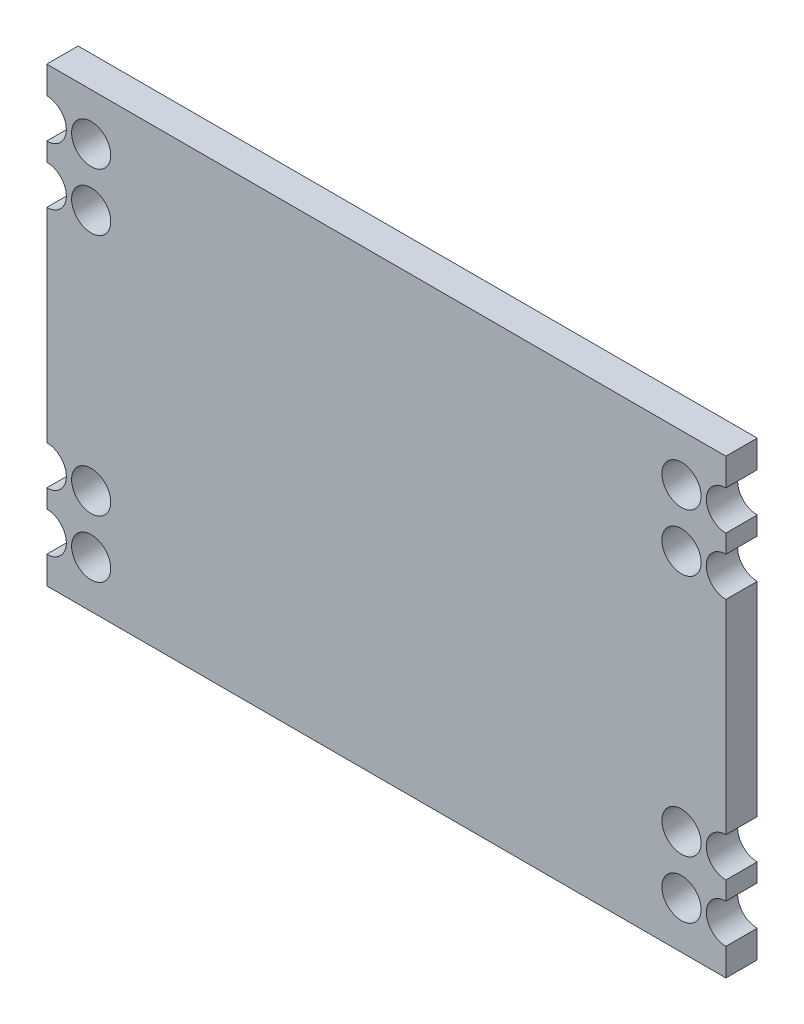
ISO-10303-21;
HEADER;
FILE_DESCRIPTION(('STEP AP214'),'2;1');
FILE_NAME('part.step','',(''),(''),'','','');
FILE_SCHEMA(('AUTOMOTIVE_DESIGN { 1 0 10303 214 1 1 1 1 }'));
ENDSEC;
DATA;
#1=APPLICATION_CONTEXT('core data for automotive mechanical design processes');
#2=APPLICATION_PROTOCOL_DEFINITION('international standard','automotive_design',2000,#1);
#3=PRODUCT_CONTEXT('',#1,'mechanical');
#4=PRODUCT('Part','Part','',(#3));
#5=PRODUCT_RELATED_PRODUCT_CATEGORY('part','',(#4));
#6=PRODUCT_DEFINITION_FORMATION('','',#4);
#7=PRODUCT_DEFINITION_CONTEXT('part definition',#1,'design');
#8=PRODUCT_DEFINITION('design','',#6,#7);
#9=PRODUCT_DEFINITION_SHAPE('','',#8);
#10=(LENGTH_UNIT() NAMED_UNIT(*) SI_UNIT(.MILLI.,.METRE.));
#11=(NAMED_UNIT(*) PLANE_ANGLE_UNIT() SI_UNIT($,.RADIAN.));
#12=(NAMED_UNIT(*) SI_UNIT($,.STERADIAN.) SOLID_ANGLE_UNIT());
#13=UNCERTAINTY_MEASURE_WITH_UNIT(LENGTH_MEASURE(1.E-05),#10,'distance_accuracy_value','');
#14=(GEOMETRIC_REPRESENTATION_CONTEXT(3) GLOBAL_UNCERTAINTY_ASSIGNED_CONTEXT((#13)) GLOBAL_UNIT_ASSIGNED_CONTEXT((#10,
#11,#12)) REPRESENTATION_CONTEXT('',''));
#15=CARTESIAN_POINT('',(0.,0.,0.));
#16=DIRECTION('',(0.,0.,1.));
#17=DIRECTION('',(1.,0.,0.));
#18=AXIS2_PLACEMENT_3D('',#15,#16,#17);
#19=CARTESIAN_POINT('',(13.,0.,1.2));
#20=DIRECTION('',(1.,0.,0.));
#21=DIRECTION('',(0.,0.,-1.));
#22=AXIS2_PLACEMENT_3D('',#19,#20,#21);
#23=PLANE('',#22);
#24=DIRECTION('',(0.,-1.,0.));
#25=VECTOR('',#24,1.);
#26=CARTESIAN_POINT('',(13.,0.,0.));
#27=LINE('',#26,#25);
#28=CARTESIAN_POINT('',(13.,3.9,0.));
#29=VERTEX_POINT('',#28);
#30=CARTESIAN_POINT('',(13.,-3.9,0.));
#31=VERTEX_POINT('',#30);
#32=EDGE_CURVE('E311',#29,#31,#27,.T.);
#33=ORIENTED_EDGE('',*,*,#32,.F.);
#34=DIRECTION('',(0.,0.,-1.));
#35=VECTOR('',#34,1.);
#36=CARTESIAN_POINT('',(13.,3.9,1.2));
#37=LINE('',#36,#35);
#38=CARTESIAN_POINT('',(13.,3.9,1.2));
#39=VERTEX_POINT('',#38);
#40=EDGE_CURVE('E11',#39,#29,#37,.T.);
#41=ORIENTED_EDGE('',*,*,#40,.F.);
#42=DIRECTION('',(0.,-1.,0.));
#43=VECTOR('',#42,1.);
#44=CARTESIAN_POINT('',(13.,0.,1.2));
#45=LINE('',#44,#43);
#46=CARTESIAN_POINT('',(13.,-3.9,1.2));
#47=VERTEX_POINT('',#46);
#48=EDGE_CURVE('E213',#39,#47,#45,.T.);
#49=ORIENTED_EDGE('',*,*,#48,.T.);
#50=DIRECTION('',(0.,0.,-1.));
#51=VECTOR('',#50,1.);
#52=CARTESIAN_POINT('',(13.,-3.9,1.2));
#53=LINE('',#52,#51);
#54=EDGE_CURVE('E63',#47,#31,#53,.T.);
#55=ORIENTED_EDGE('',*,*,#54,.T.);
#56=EDGE_LOOP('',(#33,#41,#49,#55));
#57=FACE_BOUND('',#56,.T.);
#58=ADVANCED_FACE('F45',(#57),#23,.T.);
#59=CARTESIAN_POINT('',(13.,4.65,1.2));
#60=DIRECTION('',(0.,0.,-1.));
#61=DIRECTION('',(-1.,0.,0.));
#62=AXIS2_PLACEMENT_3D('',#59,#60,#61);
#63=CYLINDRICAL_SURFACE('',#62,0.75);
#64=CARTESIAN_POINT('',(13.,4.65,0.));
#65=DIRECTION('',(0.,0.,1.));
#66=DIRECTION('',(1.,0.,0.));
#67=AXIS2_PLACEMENT_3D('',#64,#65,#66);
#68=CIRCLE('',#67,0.75);
#69=CARTESIAN_POINT('',(13.,5.4,0.));
#70=VERTEX_POINT('',#69);
#71=EDGE_CURVE('E314',#29,#70,#68,.F.);
#72=ORIENTED_EDGE('',*,*,#71,.T.);
#73=DIRECTION('',(0.,0.,-1.));
#74=VECTOR('',#73,1.);
#75=CARTESIAN_POINT('',(13.,5.4,1.2));
#76=LINE('',#75,#74);
#77=CARTESIAN_POINT('',(13.,5.4,1.2));
#78=VERTEX_POINT('',#77);
#79=EDGE_CURVE('E55',#78,#70,#76,.T.);
#80=ORIENTED_EDGE('',*,*,#79,.F.);
#81=CARTESIAN_POINT('',(13.,4.65,1.2));
#82=DIRECTION('',(0.,0.,1.));
#83=DIRECTION('',(1.,0.,0.));
#84=AXIS2_PLACEMENT_3D('',#81,#82,#83);
#85=CIRCLE('',#84,0.75);
#86=EDGE_CURVE('E225',#39,#78,#85,.F.);
#87=ORIENTED_EDGE('',*,*,#86,.F.);
#88=ORIENTED_EDGE('',*,*,#40,.T.);
#89=EDGE_LOOP('',(#72,#80,#87,#88));
#90=FACE_BOUND('',#89,.T.);
#91=ADVANCED_FACE('F425',(#90),#63,.F.);
#92=CARTESIAN_POINT('',(13.,6.09999999999999,0.));
#93=VERTEX_POINT('',#92);
#94=EDGE_CURVE('E316',#93,#70,#27,.T.);
#95=ORIENTED_EDGE('',*,*,#94,.F.);
#96=DIRECTION('',(0.,0.,-1.));
#97=VECTOR('',#96,1.);
#98=CARTESIAN_POINT('',(13.,6.09999999999999,1.2));
#99=LINE('',#98,#97);
#100=CARTESIAN_POINT('',(13.,6.09999999999999,1.2));
#101=VERTEX_POINT('',#100);
#102=EDGE_CURVE('E415',#101,#93,#99,.T.);
#103=ORIENTED_EDGE('',*,*,#102,.F.);
#104=EDGE_CURVE('E227',#101,#78,#45,.T.);
#105=ORIENTED_EDGE('',*,*,#104,.T.);
#106=ORIENTED_EDGE('',*,*,#79,.T.);
#107=EDGE_LOOP('',(#95,#103,#105,#106));
#108=FACE_BOUND('',#107,.T.);
#109=ADVANCED_FACE('F421',(#108),#23,.T.);
#110=CARTESIAN_POINT('',(13.,6.85,1.2));
#111=DIRECTION('',(0.,0.,-1.));
#112=DIRECTION('',(-1.,0.,0.));
#113=AXIS2_PLACEMENT_3D('',#110,#111,#112);
#114=CYLINDRICAL_SURFACE('',#113,0.750000000000013);
#115=CARTESIAN_POINT('',(13.,6.85,0.));
#116=DIRECTION('',(0.,0.,1.));
#117=DIRECTION('',(1.,0.,0.));
#118=AXIS2_PLACEMENT_3D('',#115,#116,#117);
#119=CIRCLE('',#118,0.750000000000013);
#120=CARTESIAN_POINT('',(13.,7.60000000000001,0.));
#121=VERTEX_POINT('',#120);
#122=EDGE_CURVE('E320',#93,#121,#119,.F.);
#123=ORIENTED_EDGE('',*,*,#122,.T.);
#124=DIRECTION('',(0.,0.,-1.));
#125=VECTOR('',#124,1.);
#126=CARTESIAN_POINT('',(13.,7.60000000000001,1.2));
#127=LINE('',#126,#125);
#128=CARTESIAN_POINT('',(13.,7.60000000000001,1.2));
#129=VERTEX_POINT('',#128);
#130=EDGE_CURVE('E413',#129,#121,#127,.T.);
#131=ORIENTED_EDGE('',*,*,#130,.F.);
#132=CARTESIAN_POINT('',(13.,6.85,1.2));
#133=DIRECTION('',(0.,0.,1.));
#134=DIRECTION('',(1.,0.,0.));
#135=AXIS2_PLACEMENT_3D('',#132,#133,#134);
#136=CIRCLE('',#135,0.750000000000013);
#137=EDGE_CURVE('E235',#101,#129,#136,.F.);
#138=ORIENTED_EDGE('',*,*,#137,.F.);
#139=ORIENTED_EDGE('',*,*,#102,.T.);
#140=EDGE_LOOP('',(#123,#131,#138,#139));
#141=FACE_BOUND('',#140,.T.);
#142=ADVANCED_FACE('F459',(#141),#114,.F.);
#143=CARTESIAN_POINT('',(13.,8.65,0.));
#144=VERTEX_POINT('',#143);
#145=EDGE_CURVE('E324',#144,#121,#27,.T.);
#146=ORIENTED_EDGE('',*,*,#145,.F.);
#147=DIRECTION('',(0.,0.,-1.));
#148=VECTOR('',#147,1.);
#149=CARTESIAN_POINT('',(13.,8.65,1.2));
#150=LINE('',#149,#148);
#151=CARTESIAN_POINT('',(13.,8.65,1.2));
#152=VERTEX_POINT('',#151);
#153=EDGE_CURVE('E411',#152,#144,#150,.T.);
#154=ORIENTED_EDGE('',*,*,#153,.F.);
#155=EDGE_CURVE('E223',#152,#129,#45,.T.);
#156=ORIENTED_EDGE('',*,*,#155,.T.);
#157=ORIENTED_EDGE('',*,*,#130,.T.);
#158=EDGE_LOOP('',(#146,#154,#156,#157));
#159=FACE_BOUND('',#158,.T.);
#160=ADVANCED_FACE('F460',(#159),#23,.T.);
#161=CARTESIAN_POINT('',(0.,8.65,1.2));
#162=DIRECTION('',(0.,1.,0.));
#163=DIRECTION('',(-1.,0.,0.));
#164=AXIS2_PLACEMENT_3D('',#161,#162,#163);
#165=PLANE('',#164);
#166=DIRECTION('',(1.,0.,0.));
#167=VECTOR('',#166,1.);
#168=CARTESIAN_POINT('',(0.,8.65,0.));
#169=LINE('',#168,#167);
#170=CARTESIAN_POINT('',(-13.,8.64999999999999,0.));
#171=VERTEX_POINT('',#170);
#172=EDGE_CURVE('E325',#171,#144,#169,.T.);
#173=ORIENTED_EDGE('',*,*,#172,.F.);
#174=DIRECTION('',(0.,0.,-1.));
#175=VECTOR('',#174,1.);
#176=CARTESIAN_POINT('',(-13.,8.64999999999999,1.2));
#177=LINE('',#176,#175);
#178=CARTESIAN_POINT('',(-13.,8.64999999999999,1.2));
#179=VERTEX_POINT('',#178);
#180=EDGE_CURVE('E408',#179,#171,#177,.T.);
#181=ORIENTED_EDGE('',*,*,#180,.F.);
#182=DIRECTION('',(1.,0.,0.));
#183=VECTOR('',#182,1.);
#184=CARTESIAN_POINT('',(0.,8.65,1.2));
#185=LINE('',#184,#183);
#186=EDGE_CURVE('E244',#179,#152,#185,.T.);
#187=ORIENTED_EDGE('',*,*,#186,.T.);
#188=ORIENTED_EDGE('',*,*,#153,.T.);
#189=EDGE_LOOP('',(#173,#181,#187,#188));
#190=FACE_BOUND('',#189,.T.);
#191=ADVANCED_FACE('F467',(#190),#165,.T.);
#192=CARTESIAN_POINT('',(-13.,0.,1.2));
#193=DIRECTION('',(1.,0.,0.));
#194=DIRECTION('',(0.,0.,-1.));
#195=AXIS2_PLACEMENT_3D('',#192,#193,#194);
#196=PLANE('',#195);
#197=DIRECTION('',(0.,-1.,0.));
#198=VECTOR('',#197,1.);
#199=CARTESIAN_POINT('',(-13.,0.,0.));
#200=LINE('',#199,#198);
#201=CARTESIAN_POINT('',(-13.,7.60000000000001,0.));
#202=VERTEX_POINT('',#201);
#203=EDGE_CURVE('E328',#171,#202,#200,.T.);
#204=ORIENTED_EDGE('',*,*,#203,.T.);
#205=DIRECTION('',(0.,0.,-1.));
#206=VECTOR('',#205,1.);
#207=CARTESIAN_POINT('',(-13.,7.60000000000001,1.2));
#208=LINE('',#207,#206);
#209=CARTESIAN_POINT('',(-13.,7.60000000000001,1.2));
#210=VERTEX_POINT('',#209);
#211=EDGE_CURVE('E406',#210,#202,#208,.T.);
#212=ORIENTED_EDGE('',*,*,#211,.F.);
#213=DIRECTION('',(0.,-1.,0.));
#214=VECTOR('',#213,1.);
#215=CARTESIAN_POINT('',(-13.,0.,1.2));
#216=LINE('',#215,#214);
#217=EDGE_CURVE('E249',#179,#210,#216,.T.);
#218=ORIENTED_EDGE('',*,*,#217,.F.);
#219=ORIENTED_EDGE('',*,*,#180,.T.);
#220=EDGE_LOOP('',(#204,#212,#218,#219));
#221=FACE_BOUND('',#220,.T.);
#222=ADVANCED_FACE('F471',(#221),#196,.F.);
#223=CARTESIAN_POINT('',(-13.,6.85,1.2));
#224=DIRECTION('',(0.,0.,-1.));
#225=DIRECTION('',(-1.,0.,0.));
#226=AXIS2_PLACEMENT_3D('',#223,#224,#225);
#227=CYLINDRICAL_SURFACE('',#226,0.750000000000013);
#228=CARTESIAN_POINT('',(-13.,6.85,0.));
#229=DIRECTION('',(0.,0.,1.));
#230=DIRECTION('',(1.,0.,0.));
#231=AXIS2_PLACEMENT_3D('',#228,#229,#230);
#232=CIRCLE('',#231,0.750000000000013);
#233=CARTESIAN_POINT('',(-13.,6.09999999999999,0.));
#234=VERTEX_POINT('',#233);
#235=EDGE_CURVE('E332',#234,#202,#232,.T.);
#236=ORIENTED_EDGE('',*,*,#235,.F.);
#237=DIRECTION('',(0.,0.,-1.));
#238=VECTOR('',#237,1.);
#239=CARTESIAN_POINT('',(-13.,6.09999999999999,1.2));
#240=LINE('',#239,#238);
#241=CARTESIAN_POINT('',(-13.,6.09999999999999,1.2));
#242=VERTEX_POINT('',#241);
#243=EDGE_CURVE('E403',#242,#234,#240,.T.);
#244=ORIENTED_EDGE('',*,*,#243,.F.);
#245=CARTESIAN_POINT('',(-13.,6.85,1.2));
#246=DIRECTION('',(0.,0.,1.));
#247=DIRECTION('',(1.,0.,0.));
#248=AXIS2_PLACEMENT_3D('',#245,#246,#247);
#249=CIRCLE('',#248,0.750000000000013);
#250=EDGE_CURVE('E256',#242,#210,#249,.T.);
#251=ORIENTED_EDGE('',*,*,#250,.T.);
#252=ORIENTED_EDGE('',*,*,#211,.T.);
#253=EDGE_LOOP('',(#236,#244,#251,#252));
#254=FACE_BOUND('',#253,.T.);
#255=ADVANCED_FACE('F535',(#254),#227,.F.);
#256=CARTESIAN_POINT('',(-13.,5.4,0.));
#257=VERTEX_POINT('',#256);
#258=EDGE_CURVE('E334',#234,#257,#200,.T.);
#259=ORIENTED_EDGE('',*,*,#258,.T.);
#260=DIRECTION('',(0.,0.,-1.));
#261=VECTOR('',#260,1.);
#262=CARTESIAN_POINT('',(-13.,5.4,1.2));
#263=LINE('',#262,#261);
#264=CARTESIAN_POINT('',(-13.,5.4,1.2));
#265=VERTEX_POINT('',#264);
#266=EDGE_CURVE('E400',#265,#257,#263,.T.);
#267=ORIENTED_EDGE('',*,*,#266,.F.);
#268=EDGE_CURVE('E259',#242,#265,#216,.T.);
#269=ORIENTED_EDGE('',*,*,#268,.F.);
#270=ORIENTED_EDGE('',*,*,#243,.T.);
#271=EDGE_LOOP('',(#259,#267,#269,#270));
#272=FACE_BOUND('',#271,.T.);
#273=ADVANCED_FACE('F509',(#272),#196,.F.);
#274=CARTESIAN_POINT('',(-13.,4.65,1.2));
#275=DIRECTION('',(0.,0.,-1.));
#276=DIRECTION('',(-1.,0.,0.));
#277=AXIS2_PLACEMENT_3D('',#274,#275,#276);
#278=CYLINDRICAL_SURFACE('',#277,0.75);
#279=CARTESIAN_POINT('',(-13.,4.65,0.));
#280=DIRECTION('',(0.,0.,1.));
#281=DIRECTION('',(1.,0.,0.));
#282=AXIS2_PLACEMENT_3D('',#279,#280,#281);
#283=CIRCLE('',#282,0.75);
#284=CARTESIAN_POINT('',(-13.,3.9,0.));
#285=VERTEX_POINT('',#284);
#286=EDGE_CURVE('E338',#285,#257,#283,.T.);
#287=ORIENTED_EDGE('',*,*,#286,.F.);
#288=DIRECTION('',(0.,0.,-1.));
#289=VECTOR('',#288,1.);
#290=CARTESIAN_POINT('',(-13.,3.9,1.2));
#291=LINE('',#290,#289);
#292=CARTESIAN_POINT('',(-13.,3.9,1.2));
#293=VERTEX_POINT('',#292);
#294=EDGE_CURVE('E397',#293,#285,#291,.T.);
#295=ORIENTED_EDGE('',*,*,#294,.F.);
#296=CARTESIAN_POINT('',(-13.,4.65,1.2));
#297=DIRECTION('',(0.,0.,1.));
#298=DIRECTION('',(1.,0.,0.));
#299=AXIS2_PLACEMENT_3D('',#296,#297,#298);
#300=CIRCLE('',#299,0.75);
#301=EDGE_CURVE('E264',#293,#265,#300,.T.);
#302=ORIENTED_EDGE('',*,*,#301,.T.);
#303=ORIENTED_EDGE('',*,*,#266,.T.);
#304=EDGE_LOOP('',(#287,#295,#302,#303));
#305=FACE_BOUND('',#304,.T.);
#306=ADVANCED_FACE('F514',(#305),#278,.F.);
#307=CARTESIAN_POINT('',(-13.,-3.9,0.));
#308=VERTEX_POINT('',#307);
#309=EDGE_CURVE('E342',#285,#308,#200,.T.);
#310=ORIENTED_EDGE('',*,*,#309,.T.);
#311=DIRECTION('',(0.,0.,-1.));
#312=VECTOR('',#311,1.);
#313=CARTESIAN_POINT('',(-13.,-3.9,1.2));
#314=LINE('',#313,#312);
#315=CARTESIAN_POINT('',(-13.,-3.9,1.2));
#316=VERTEX_POINT('',#315);
#317=EDGE_CURVE('E393',#316,#308,#314,.T.);
#318=ORIENTED_EDGE('',*,*,#317,.F.);
#319=EDGE_CURVE('E268',#293,#316,#216,.T.);
#320=ORIENTED_EDGE('',*,*,#319,.F.);
#321=ORIENTED_EDGE('',*,*,#294,.T.);
#322=EDGE_LOOP('',(#310,#318,#320,#321));
#323=FACE_BOUND('',#322,.T.);
#324=ADVANCED_FACE('F523',(#323),#196,.F.);
#325=CARTESIAN_POINT('',(-13.,-4.65,1.2));
#326=DIRECTION('',(0.,0.,-1.));
#327=DIRECTION('',(-1.,0.,0.));
#328=AXIS2_PLACEMENT_3D('',#325,#326,#327);
#329=CYLINDRICAL_SURFACE('',#328,0.75);
#330=CARTESIAN_POINT('',(-13.,-4.65,0.));
#331=DIRECTION('',(0.,0.,1.));
#332=DIRECTION('',(1.,0.,0.));
#333=AXIS2_PLACEMENT_3D('',#330,#331,#332);
#334=CIRCLE('',#333,0.75);
#335=CARTESIAN_POINT('',(-13.,-5.4,0.));
#336=VERTEX_POINT('',#335);
#337=EDGE_CURVE('E343',#308,#336,#334,.F.);
#338=ORIENTED_EDGE('',*,*,#337,.T.);
#339=DIRECTION('',(0.,0.,-1.));
#340=VECTOR('',#339,1.);
#341=CARTESIAN_POINT('',(-13.,-5.4,1.2));
#342=LINE('',#341,#340);
#343=CARTESIAN_POINT('',(-13.,-5.4,1.2));
#344=VERTEX_POINT('',#343);
#345=EDGE_CURVE('E389',#344,#336,#342,.T.);
#346=ORIENTED_EDGE('',*,*,#345,.F.);
#347=CARTESIAN_POINT('',(-13.,-4.65,1.2));
#348=DIRECTION('',(0.,0.,1.));
#349=DIRECTION('',(1.,0.,0.));
#350=AXIS2_PLACEMENT_3D('',#347,#348,#349);
#351=CIRCLE('',#350,0.75);
#352=EDGE_CURVE('E269',#316,#344,#351,.F.);
#353=ORIENTED_EDGE('',*,*,#352,.F.);
#354=ORIENTED_EDGE('',*,*,#317,.T.);
#355=EDGE_LOOP('',(#338,#346,#353,#354));
#356=FACE_BOUND('',#355,.T.);
#357=ADVANCED_FACE('F522',(#356),#329,.F.);
#358=CARTESIAN_POINT('',(-13.,-6.09999999999999,0.));
#359=VERTEX_POINT('',#358);
#360=EDGE_CURVE('E347',#336,#359,#200,.T.);
#361=ORIENTED_EDGE('',*,*,#360,.T.);
#362=DIRECTION('',(0.,0.,-1.));
#363=VECTOR('',#362,1.);
#364=CARTESIAN_POINT('',(-13.,-6.09999999999999,1.2));
#365=LINE('',#364,#363);
#366=CARTESIAN_POINT('',(-13.,-6.09999999999999,1.2));
#367=VERTEX_POINT('',#366);
#368=EDGE_CURVE('E385',#367,#359,#365,.T.);
#369=ORIENTED_EDGE('',*,*,#368,.F.);
#370=EDGE_CURVE('E273',#344,#367,#216,.T.);
#371=ORIENTED_EDGE('',*,*,#370,.F.);
#372=ORIENTED_EDGE('',*,*,#345,.T.);
#373=EDGE_LOOP('',(#361,#369,#371,#372));
#374=FACE_BOUND('',#373,.T.);
#375=ADVANCED_FACE('F496',(#374),#196,.F.);
#376=CARTESIAN_POINT('',(-13.,-6.85,1.2));
#377=DIRECTION('',(0.,0.,-1.));
#378=DIRECTION('',(-1.,0.,0.));
#379=AXIS2_PLACEMENT_3D('',#376,#377,#378);
#380=CYLINDRICAL_SURFACE('',#379,0.750000000000013);
#381=CARTESIAN_POINT('',(-13.,-6.85,0.));
#382=DIRECTION('',(0.,0.,1.));
#383=DIRECTION('',(1.,0.,0.));
#384=AXIS2_PLACEMENT_3D('',#381,#382,#383);
#385=CIRCLE('',#384,0.750000000000013);
#386=CARTESIAN_POINT('',(-13.,-7.60000000000001,0.));
#387=VERTEX_POINT('',#386);
#388=EDGE_CURVE('E348',#359,#387,#385,.F.);
#389=ORIENTED_EDGE('',*,*,#388,.T.);
#390=DIRECTION('',(0.,0.,-1.));
#391=VECTOR('',#390,1.);
#392=CARTESIAN_POINT('',(-13.,-7.60000000000001,1.2));
#393=LINE('',#392,#391);
#394=CARTESIAN_POINT('',(-13.,-7.60000000000001,1.2));
#395=VERTEX_POINT('',#394);
#396=EDGE_CURVE('E381',#395,#387,#393,.T.);
#397=ORIENTED_EDGE('',*,*,#396,.F.);
#398=CARTESIAN_POINT('',(-13.,-6.85,1.2));
#399=DIRECTION('',(0.,0.,1.));
#400=DIRECTION('',(1.,0.,0.));
#401=AXIS2_PLACEMENT_3D('',#398,#399,#400);
#402=CIRCLE('',#401,0.750000000000013);
#403=EDGE_CURVE('E274',#367,#395,#402,.F.);
#404=ORIENTED_EDGE('',*,*,#403,.F.);
#405=ORIENTED_EDGE('',*,*,#368,.T.);
#406=EDGE_LOOP('',(#389,#397,#404,#405));
#407=FACE_BOUND('',#406,.T.);
#408=ADVANCED_FACE('F491',(#407),#380,.F.);
#409=CARTESIAN_POINT('',(-13.,-8.65,0.));
#410=VERTEX_POINT('',#409);
#411=EDGE_CURVE('E333',#387,#410,#200,.T.);
#412=ORIENTED_EDGE('',*,*,#411,.T.);
#413=DIRECTION('',(0.,0.,-1.));
#414=VECTOR('',#413,1.);
#415=CARTESIAN_POINT('',(-13.,-8.65,1.2));
#416=LINE('',#415,#414);
#417=CARTESIAN_POINT('',(-13.,-8.65,1.2));
#418=VERTEX_POINT('',#417);
#419=EDGE_CURVE('E377',#418,#410,#416,.T.);
#420=ORIENTED_EDGE('',*,*,#419,.F.);
#421=EDGE_CURVE('E258',#395,#418,#216,.T.);
#422=ORIENTED_EDGE('',*,*,#421,.F.);
#423=ORIENTED_EDGE('',*,*,#396,.T.);
#424=EDGE_LOOP('',(#412,#420,#422,#423));
#425=FACE_BOUND('',#424,.T.);
#426=ADVANCED_FACE('F480',(#425),#196,.F.);
#427=CARTESIAN_POINT('',(0.,-8.65,1.2));
#428=DIRECTION('',(0.,1.,0.));
#429=DIRECTION('',(-1.,0.,0.));
#430=AXIS2_PLACEMENT_3D('',#427,#428,#429);
#431=PLANE('',#430);
#432=DIRECTION('',(1.,0.,0.));
#433=VECTOR('',#432,1.);
#434=CARTESIAN_POINT('',(0.,-8.65,0.));
#435=LINE('',#434,#433);
#436=CARTESIAN_POINT('',(13.,-8.65,0.));
#437=VERTEX_POINT('',#436);
#438=EDGE_CURVE('E352',#410,#437,#435,.T.);
#439=ORIENTED_EDGE('',*,*,#438,.T.);
#440=DIRECTION('',(0.,0.,-1.));
#441=VECTOR('',#440,1.);
#442=CARTESIAN_POINT('',(13.,-8.65,1.2));
#443=LINE('',#442,#441);
#444=CARTESIAN_POINT('',(13.,-8.65,1.2));
#445=VERTEX_POINT('',#444);
#446=EDGE_CURVE('E374',#445,#437,#443,.T.);
#447=ORIENTED_EDGE('',*,*,#446,.F.);
#448=DIRECTION('',(1.,0.,0.));
#449=VECTOR('',#448,1.);
#450=CARTESIAN_POINT('',(0.,-8.65,1.2));
#451=LINE('',#450,#449);
#452=EDGE_CURVE('E222',#418,#445,#451,.T.);
#453=ORIENTED_EDGE('',*,*,#452,.F.);
#454=ORIENTED_EDGE('',*,*,#419,.T.);
#455=EDGE_LOOP('',(#439,#447,#453,#454));
#456=FACE_BOUND('',#455,.T.);
#457=ADVANCED_FACE('F474',(#456),#431,.F.);
#458=CARTESIAN_POINT('',(13.,-7.60000000000001,0.));
#459=VERTEX_POINT('',#458);
#460=EDGE_CURVE('E356',#459,#437,#27,.T.);
#461=ORIENTED_EDGE('',*,*,#460,.F.);
#462=DIRECTION('',(0.,0.,-1.));
#463=VECTOR('',#462,1.);
#464=CARTESIAN_POINT('',(13.,-7.60000000000001,1.2));
#465=LINE('',#464,#463);
#466=CARTESIAN_POINT('',(13.,-7.60000000000001,1.2));
#467=VERTEX_POINT('',#466);
#468=EDGE_CURVE('E195',#467,#459,#465,.T.);
#469=ORIENTED_EDGE('',*,*,#468,.F.);
#470=EDGE_CURVE('E206',#467,#445,#45,.T.);
#471=ORIENTED_EDGE('',*,*,#470,.T.);
#472=ORIENTED_EDGE('',*,*,#446,.T.);
#473=EDGE_LOOP('',(#461,#469,#471,#472));
#474=FACE_BOUND('',#473,.T.);
#475=ADVANCED_FACE('F450',(#474),#23,.T.);
#476=CARTESIAN_POINT('',(13.,-6.85,1.2));
#477=DIRECTION('',(0.,0.,-1.));
#478=DIRECTION('',(-1.,0.,0.));
#479=AXIS2_PLACEMENT_3D('',#476,#477,#478);
#480=CYLINDRICAL_SURFACE('',#479,0.750000000000013);
#481=CARTESIAN_POINT('',(13.,-6.85,0.));
#482=DIRECTION('',(0.,0.,1.));
#483=DIRECTION('',(1.,0.,0.));
#484=AXIS2_PLACEMENT_3D('',#481,#482,#483);
#485=CIRCLE('',#484,0.750000000000013);
#486=CARTESIAN_POINT('',(13.,-6.09999999999999,0.));
#487=VERTEX_POINT('',#486);
#488=EDGE_CURVE('E190',#487,#459,#485,.T.);
#489=ORIENTED_EDGE('',*,*,#488,.F.);
#490=DIRECTION('',(0.,0.,-1.));
#491=VECTOR('',#490,1.);
#492=CARTESIAN_POINT('',(13.,-6.09999999999999,1.2));
#493=LINE('',#492,#491);
#494=CARTESIAN_POINT('',(13.,-6.09999999999999,1.2));
#495=VERTEX_POINT('',#494);
#496=EDGE_CURVE('E185',#495,#487,#493,.T.);
#497=ORIENTED_EDGE('',*,*,#496,.F.);
#498=CARTESIAN_POINT('',(13.,-6.85,1.2));
#499=DIRECTION('',(0.,0.,1.));
#500=DIRECTION('',(1.,0.,0.));
#501=AXIS2_PLACEMENT_3D('',#498,#499,#500);
#502=CIRCLE('',#501,0.750000000000013);
#503=EDGE_CURVE('E188',#495,#467,#502,.T.);
#504=ORIENTED_EDGE('',*,*,#503,.T.);
#505=ORIENTED_EDGE('',*,*,#468,.T.);
#506=EDGE_LOOP('',(#489,#497,#504,#505));
#507=FACE_BOUND('',#506,.T.);
#508=ADVANCED_FACE('F187',(#507),#480,.F.);
#509=CARTESIAN_POINT('',(13.,-5.4,0.));
#510=VERTEX_POINT('',#509);
#511=EDGE_CURVE('E315',#510,#487,#27,.T.);
#512=ORIENTED_EDGE('',*,*,#511,.F.);
#513=DIRECTION('',(0.,0.,-1.));
#514=VECTOR('',#513,1.);
#515=CARTESIAN_POINT('',(13.,-5.4,1.2));
#516=LINE('',#515,#514);
#517=CARTESIAN_POINT('',(13.,-5.4,1.2));
#518=VERTEX_POINT('',#517);
#519=EDGE_CURVE('E124',#518,#510,#516,.T.);
#520=ORIENTED_EDGE('',*,*,#519,.F.);
#521=EDGE_CURVE('E204',#518,#495,#45,.T.);
#522=ORIENTED_EDGE('',*,*,#521,.T.);
#523=ORIENTED_EDGE('',*,*,#496,.T.);
#524=EDGE_LOOP('',(#512,#520,#522,#523));
#525=FACE_BOUND('',#524,.T.);
#526=ADVANCED_FACE('F209',(#525),#23,.T.);
#527=CARTESIAN_POINT('',(13.,-4.65,1.2));
#528=DIRECTION('',(0.,0.,-1.));
#529=DIRECTION('',(-1.,0.,0.));
#530=AXIS2_PLACEMENT_3D('',#527,#528,#529);
#531=CYLINDRICAL_SURFACE('',#530,0.75);
#532=CARTESIAN_POINT('',(13.,-4.65,0.));
#533=DIRECTION('',(0.,0.,1.));
#534=DIRECTION('',(1.,0.,0.));
#535=AXIS2_PLACEMENT_3D('',#532,#533,#534);
#536=CIRCLE('',#535,0.75);
#537=EDGE_CURVE('E359',#31,#510,#536,.T.);
#538=ORIENTED_EDGE('',*,*,#537,.F.);
#539=ORIENTED_EDGE('',*,*,#54,.F.);
#540=CARTESIAN_POINT('',(13.,-4.65,1.2));
#541=DIRECTION('',(0.,0.,1.));
#542=DIRECTION('',(1.,0.,0.));
#543=AXIS2_PLACEMENT_3D('',#540,#541,#542);
#544=CIRCLE('',#543,0.75);
#545=EDGE_CURVE('E211',#47,#518,#544,.T.);
#546=ORIENTED_EDGE('',*,*,#545,.T.);
#547=ORIENTED_EDGE('',*,*,#519,.T.);
#548=EDGE_LOOP('',(#538,#539,#546,#547));
#549=FACE_BOUND('',#548,.T.);
#550=ADVANCED_FACE('F438',(#549),#531,.F.);
#551=CARTESIAN_POINT('',(-11.3,-6.85000000000003,1.2));
#552=DIRECTION('',(0.,0.,-1.));
#553=DIRECTION('',(-1.,0.,0.));
#554=AXIS2_PLACEMENT_3D('',#551,#552,#553);
#555=CYLINDRICAL_SURFACE('',#554,0.749999999999984);
#556=CARTESIAN_POINT('',(-11.3,-6.85000000000003,1.2));
#557=DIRECTION('',(0.,0.,1.));
#558=DIRECTION('',(1.,0.,0.));
#559=AXIS2_PLACEMENT_3D('',#556,#557,#558);
#560=CIRCLE('',#559,0.749999999999984);
#561=CARTESIAN_POINT('',(-10.55,-6.85000000000003,1.2));
#562=VERTEX_POINT('',#561);
#563=EDGE_CURVE('E226',#562,#562,#560,.F.);
#564=ORIENTED_EDGE('',*,*,#563,.F.);
#565=EDGE_LOOP('',(#564));
#566=FACE_BOUND('',#565,.T.);
#567=CARTESIAN_POINT('',(-11.3,-6.85000000000003,0.));
#568=DIRECTION('',(0.,0.,1.));
#569=DIRECTION('',(1.,0.,0.));
#570=AXIS2_PLACEMENT_3D('',#567,#568,#569);
#571=CIRCLE('',#570,0.749999999999984);
#572=CARTESIAN_POINT('',(-10.55,-6.85000000000003,0.));
#573=VERTEX_POINT('',#572);
#574=EDGE_CURVE('E307',#573,#573,#571,.F.);
#575=ORIENTED_EDGE('',*,*,#574,.T.);
#576=EDGE_LOOP('',(#575));
#577=FACE_BOUND('',#576,.T.);
#578=ADVANCED_FACE('F440',(#566,#577),#555,.F.);
#579=CARTESIAN_POINT('',(-11.3,6.85000000000003,1.2));
#580=DIRECTION('',(0.,0.,-1.));
#581=DIRECTION('',(-1.,0.,0.));
#582=AXIS2_PLACEMENT_3D('',#579,#580,#581);
#583=CYLINDRICAL_SURFACE('',#582,0.749999999999984);
#584=CARTESIAN_POINT('',(-11.3,6.85000000000003,1.2));
#585=DIRECTION('',(0.,0.,1.));
#586=DIRECTION('',(1.,0.,0.));
#587=AXIS2_PLACEMENT_3D('',#584,#585,#586);
#588=CIRCLE('',#587,0.749999999999984);
#589=CARTESIAN_POINT('',(-10.55,6.85000000000003,1.2));
#590=VERTEX_POINT('',#589);
#591=EDGE_CURVE('E232',#590,#590,#588,.T.);
#592=ORIENTED_EDGE('',*,*,#591,.T.);
#593=EDGE_LOOP('',(#592));
#594=FACE_BOUND('',#593,.T.);
#595=CARTESIAN_POINT('',(-11.3,6.85000000000003,0.));
#596=DIRECTION('',(0.,0.,1.));
#597=DIRECTION('',(1.,0.,0.));
#598=AXIS2_PLACEMENT_3D('',#595,#596,#597);
#599=CIRCLE('',#598,0.749999999999984);
#600=CARTESIAN_POINT('',(-10.55,6.85000000000003,0.));
#601=VERTEX_POINT('',#600);
#602=EDGE_CURVE('E303',#601,#601,#599,.T.);
#603=ORIENTED_EDGE('',*,*,#602,.F.);
#604=EDGE_LOOP('',(#603));
#605=FACE_BOUND('',#604,.T.);
#606=ADVANCED_FACE('F446',(#594,#605),#583,.F.);
#607=CARTESIAN_POINT('',(-11.3,4.65000000000003,1.2));
#608=DIRECTION('',(0.,0.,-1.));
#609=DIRECTION('',(-1.,0.,0.));
#610=AXIS2_PLACEMENT_3D('',#607,#608,#609);
#611=CYLINDRICAL_SURFACE('',#610,0.75);
#612=CARTESIAN_POINT('',(-11.3,4.65000000000003,1.2));
#613=DIRECTION('',(0.,0.,1.));
#614=DIRECTION('',(1.,0.,0.));
#615=AXIS2_PLACEMENT_3D('',#612,#613,#614);
#616=CIRCLE('',#615,0.75);
#617=CARTESIAN_POINT('',(-10.55,4.65000000000003,1.2));
#618=VERTEX_POINT('',#617);
#619=EDGE_CURVE('E811',#618,#618,#616,.T.);
#620=ORIENTED_EDGE('',*,*,#619,.T.);
#621=EDGE_LOOP('',(#620));
#622=FACE_BOUND('',#621,.T.);
#623=CARTESIAN_POINT('',(-11.3,4.65000000000003,0.));
#624=DIRECTION('',(0.,0.,1.));
#625=DIRECTION('',(1.,0.,0.));
#626=AXIS2_PLACEMENT_3D('',#623,#624,#625);
#627=CIRCLE('',#626,0.75);
#628=CARTESIAN_POINT('',(-10.55,4.65000000000003,0.));
#629=VERTEX_POINT('',#628);
#630=EDGE_CURVE('E299',#629,#629,#627,.T.);
#631=ORIENTED_EDGE('',*,*,#630,.F.);
#632=EDGE_LOOP('',(#631));
#633=FACE_BOUND('',#632,.T.);
#634=ADVANCED_FACE('F554',(#622,#633),#611,.F.);
#635=CARTESIAN_POINT('',(-11.3,-4.65000000000003,1.2));
#636=DIRECTION('',(0.,0.,-1.));
#637=DIRECTION('',(-1.,0.,0.));
#638=AXIS2_PLACEMENT_3D('',#635,#636,#637);
#639=CYLINDRICAL_SURFACE('',#638,0.75);
#640=CARTESIAN_POINT('',(-11.3,-4.65000000000003,1.2));
#641=DIRECTION('',(0.,0.,1.));
#642=DIRECTION('',(1.,0.,0.));
#643=AXIS2_PLACEMENT_3D('',#640,#641,#642);
#644=CIRCLE('',#643,0.75);
#645=CARTESIAN_POINT('',(-10.55,-4.65000000000003,1.2));
#646=VERTEX_POINT('',#645);
#647=EDGE_CURVE('E807',#646,#646,#644,.F.);
#648=ORIENTED_EDGE('',*,*,#647,.F.);
#649=EDGE_LOOP('',(#648));
#650=FACE_BOUND('',#649,.T.);
#651=CARTESIAN_POINT('',(-11.3,-4.65000000000003,0.));
#652=DIRECTION('',(0.,0.,1.));
#653=DIRECTION('',(1.,0.,0.));
#654=AXIS2_PLACEMENT_3D('',#651,#652,#653);
#655=CIRCLE('',#654,0.75);
#656=CARTESIAN_POINT('',(-10.55,-4.65000000000003,0.));
#657=VERTEX_POINT('',#656);
#658=EDGE_CURVE('E295',#657,#657,#655,.F.);
#659=ORIENTED_EDGE('',*,*,#658,.T.);
#660=EDGE_LOOP('',(#659));
#661=FACE_BOUND('',#660,.T.);
#662=ADVANCED_FACE('F558',(#650,#661),#639,.F.);
#663=CARTESIAN_POINT('',(11.3,-6.85000000000003,1.2));
#664=DIRECTION('',(0.,0.,-1.));
#665=DIRECTION('',(-1.,0.,0.));
#666=AXIS2_PLACEMENT_3D('',#663,#664,#665);
#667=CYLINDRICAL_SURFACE('',#666,0.749999999999984);
#668=CARTESIAN_POINT('',(11.3,-6.85000000000003,1.2));
#669=DIRECTION('',(0.,0.,1.));
#670=DIRECTION('',(1.,0.,0.));
#671=AXIS2_PLACEMENT_3D('',#668,#669,#670);
#672=CIRCLE('',#671,0.749999999999984);
#673=CARTESIAN_POINT('',(12.05,-6.85000000000003,1.2));
#674=VERTEX_POINT('',#673);
#675=EDGE_CURVE('E803',#674,#674,#672,.T.);
#676=ORIENTED_EDGE('',*,*,#675,.T.);
#677=EDGE_LOOP('',(#676));
#678=FACE_BOUND('',#677,.T.);
#679=CARTESIAN_POINT('',(11.3,-6.85000000000003,0.));
#680=DIRECTION('',(0.,0.,1.));
#681=DIRECTION('',(1.,0.,0.));
#682=AXIS2_PLACEMENT_3D('',#679,#680,#681);
#683=CIRCLE('',#682,0.749999999999984);
#684=CARTESIAN_POINT('',(12.05,-6.85000000000003,0.));
#685=VERTEX_POINT('',#684);
#686=EDGE_CURVE('E291',#685,#685,#683,.T.);
#687=ORIENTED_EDGE('',*,*,#686,.F.);
#688=EDGE_LOOP('',(#687));
#689=FACE_BOUND('',#688,.T.);
#690=ADVANCED_FACE('F562',(#678,#689),#667,.F.);
#691=CARTESIAN_POINT('',(11.3,-4.65000000000003,1.2));
#692=DIRECTION('',(0.,0.,-1.));
#693=DIRECTION('',(-1.,0.,0.));
#694=AXIS2_PLACEMENT_3D('',#691,#692,#693);
#695=CYLINDRICAL_SURFACE('',#694,0.75);
#696=CARTESIAN_POINT('',(11.3,-4.65000000000003,1.2));
#697=DIRECTION('',(0.,0.,1.));
#698=DIRECTION('',(1.,0.,0.));
#699=AXIS2_PLACEMENT_3D('',#696,#697,#698);
#700=CIRCLE('',#699,0.75);
#701=CARTESIAN_POINT('',(12.05,-4.65000000000003,1.2));
#702=VERTEX_POINT('',#701);
#703=EDGE_CURVE('E577',#702,#702,#700,.T.);
#704=ORIENTED_EDGE('',*,*,#703,.T.);
#705=EDGE_LOOP('',(#704));
#706=FACE_BOUND('',#705,.T.);
#707=CARTESIAN_POINT('',(11.3,-4.65000000000003,0.));
#708=DIRECTION('',(0.,0.,1.));
#709=DIRECTION('',(1.,0.,0.));
#710=AXIS2_PLACEMENT_3D('',#707,#708,#709);
#711=CIRCLE('',#710,0.75);
#712=CARTESIAN_POINT('',(12.05,-4.65000000000003,0.));
#713=VERTEX_POINT('',#712);
#714=EDGE_CURVE('E287',#713,#713,#711,.T.);
#715=ORIENTED_EDGE('',*,*,#714,.F.);
#716=EDGE_LOOP('',(#715));
#717=FACE_BOUND('',#716,.T.);
#718=ADVANCED_FACE('F565',(#706,#717),#695,.F.);
#719=CARTESIAN_POINT('',(11.3,6.85000000000003,1.2));
#720=DIRECTION('',(0.,0.,-1.));
#721=DIRECTION('',(-1.,0.,0.));
#722=AXIS2_PLACEMENT_3D('',#719,#720,#721);
#723=CYLINDRICAL_SURFACE('',#722,0.749999999999984);
#724=CARTESIAN_POINT('',(11.3,6.85000000000003,1.2));
#725=DIRECTION('',(0.,0.,1.));
#726=DIRECTION('',(1.,0.,0.));
#727=AXIS2_PLACEMENT_3D('',#724,#725,#726);
#728=CIRCLE('',#727,0.749999999999984);
#729=CARTESIAN_POINT('',(12.05,6.85000000000003,1.2));
#730=VERTEX_POINT('',#729);
#731=EDGE_CURVE('E367',#730,#730,#728,.F.);
#732=ORIENTED_EDGE('',*,*,#731,.F.);
#733=EDGE_LOOP('',(#732));
#734=FACE_BOUND('',#733,.T.);
#735=CARTESIAN_POINT('',(11.3,6.85000000000003,0.));
#736=DIRECTION('',(0.,0.,1.));
#737=DIRECTION('',(1.,0.,0.));
#738=AXIS2_PLACEMENT_3D('',#735,#736,#737);
#739=CIRCLE('',#738,0.749999999999984);
#740=CARTESIAN_POINT('',(12.05,6.85000000000003,0.));
#741=VERTEX_POINT('',#740);
#742=EDGE_CURVE('E283',#741,#741,#739,.F.);
#743=ORIENTED_EDGE('',*,*,#742,.T.);
#744=EDGE_LOOP('',(#743));
#745=FACE_BOUND('',#744,.T.);
#746=ADVANCED_FACE('F47',(#734,#745),#723,.F.);
#747=CARTESIAN_POINT('',(11.3,4.65000000000003,1.2));
#748=DIRECTION('',(0.,0.,-1.));
#749=DIRECTION('',(-1.,0.,0.));
#750=AXIS2_PLACEMENT_3D('',#747,#748,#749);
#751=CYLINDRICAL_SURFACE('',#750,0.75);
#752=CARTESIAN_POINT('',(11.3,4.65000000000003,1.2));
#753=DIRECTION('',(0.,0.,1.));
#754=DIRECTION('',(1.,0.,0.));
#755=AXIS2_PLACEMENT_3D('',#752,#753,#754);
#756=CIRCLE('',#755,0.75);
#757=CARTESIAN_POINT('',(12.05,4.65000000000003,1.2));
#758=VERTEX_POINT('',#757);
#759=EDGE_CURVE('E217',#758,#758,#756,.F.);
#760=ORIENTED_EDGE('',*,*,#759,.F.);
#761=EDGE_LOOP('',(#760));
#762=FACE_BOUND('',#761,.T.);
#763=CARTESIAN_POINT('',(11.3,4.65000000000003,0.));
#764=DIRECTION('',(0.,0.,1.));
#765=DIRECTION('',(1.,0.,0.));
#766=AXIS2_PLACEMENT_3D('',#763,#764,#765);
#767=CIRCLE('',#766,0.75);
#768=CARTESIAN_POINT('',(12.05,4.65000000000003,0.));
#769=VERTEX_POINT('',#768);
#770=EDGE_CURVE('E363',#769,#769,#767,.F.);
#771=ORIENTED_EDGE('',*,*,#770,.T.);
#772=EDGE_LOOP('',(#771));
#773=FACE_BOUND('',#772,.T.);
#774=ADVANCED_FACE('F572',(#762,#773),#751,.F.);
#775=CARTESIAN_POINT('',(0.,0.,1.2));
#776=DIRECTION('',(0.,0.,1.));
#777=DIRECTION('',(1.,0.,0.));
#778=AXIS2_PLACEMENT_3D('',#775,#776,#777);
#779=PLANE('',#778);
#780=ORIENTED_EDGE('',*,*,#731,.T.);
#781=EDGE_LOOP('',(#780));
#782=FACE_BOUND('',#781,.T.);
#783=ORIENTED_EDGE('',*,*,#703,.F.);
#784=EDGE_LOOP('',(#783));
#785=FACE_BOUND('',#784,.T.);
#786=ORIENTED_EDGE('',*,*,#675,.F.);
#787=EDGE_LOOP('',(#786));
#788=FACE_BOUND('',#787,.T.);
#789=ORIENTED_EDGE('',*,*,#647,.T.);
#790=EDGE_LOOP('',(#789));
#791=FACE_BOUND('',#790,.T.);
#792=ORIENTED_EDGE('',*,*,#619,.F.);
#793=EDGE_LOOP('',(#792));
#794=FACE_BOUND('',#793,.T.);
#795=ORIENTED_EDGE('',*,*,#591,.F.);
#796=EDGE_LOOP('',(#795));
#797=FACE_BOUND('',#796,.T.);
#798=ORIENTED_EDGE('',*,*,#563,.T.);
#799=EDGE_LOOP('',(#798));
#800=FACE_BOUND('',#799,.T.);
#801=ORIENTED_EDGE('',*,*,#48,.F.);
#802=ORIENTED_EDGE('',*,*,#86,.T.);
#803=ORIENTED_EDGE('',*,*,#104,.F.);
#804=ORIENTED_EDGE('',*,*,#137,.T.);
#805=ORIENTED_EDGE('',*,*,#155,.F.);
#806=ORIENTED_EDGE('',*,*,#186,.F.);
#807=ORIENTED_EDGE('',*,*,#217,.T.);
#808=ORIENTED_EDGE('',*,*,#250,.F.);
#809=ORIENTED_EDGE('',*,*,#268,.T.);
#810=ORIENTED_EDGE('',*,*,#301,.F.);
#811=ORIENTED_EDGE('',*,*,#319,.T.);
#812=ORIENTED_EDGE('',*,*,#352,.T.);
#813=ORIENTED_EDGE('',*,*,#370,.T.);
#814=ORIENTED_EDGE('',*,*,#403,.T.);
#815=ORIENTED_EDGE('',*,*,#421,.T.);
#816=ORIENTED_EDGE('',*,*,#452,.T.);
#817=ORIENTED_EDGE('',*,*,#470,.F.);
#818=ORIENTED_EDGE('',*,*,#503,.F.);
#819=ORIENTED_EDGE('',*,*,#521,.F.);
#820=ORIENTED_EDGE('',*,*,#545,.F.);
#821=EDGE_LOOP('',(#801,#802,#803,#804,#805,#806,#807,#808,#809,#810,#811,#812,#813,#814,#815,
#816,#817,#818,#819,#820));
#822=FACE_BOUND('',#821,.T.);
#823=ORIENTED_EDGE('',*,*,#759,.T.);
#824=EDGE_LOOP('',(#823));
#825=FACE_BOUND('',#824,.T.);
#826=ADVANCED_FACE('F201',(#782,#785,#788,#791,#794,#797,#800,#822,#825),#779,.T.);
#827=CARTESIAN_POINT('',(0.,0.,0.));
#828=DIRECTION('',(0.,0.,1.));
#829=DIRECTION('',(1.,0.,0.));
#830=AXIS2_PLACEMENT_3D('',#827,#828,#829);
#831=PLANE('',#830);
#832=ORIENTED_EDGE('',*,*,#742,.F.);
#833=EDGE_LOOP('',(#832));
#834=FACE_BOUND('',#833,.T.);
#835=ORIENTED_EDGE('',*,*,#714,.T.);
#836=EDGE_LOOP('',(#835));
#837=FACE_BOUND('',#836,.T.);
#838=ORIENTED_EDGE('',*,*,#686,.T.);
#839=EDGE_LOOP('',(#838));
#840=FACE_BOUND('',#839,.T.);
#841=ORIENTED_EDGE('',*,*,#658,.F.);
#842=EDGE_LOOP('',(#841));
#843=FACE_BOUND('',#842,.T.);
#844=ORIENTED_EDGE('',*,*,#630,.T.);
#845=EDGE_LOOP('',(#844));
#846=FACE_BOUND('',#845,.T.);
#847=ORIENTED_EDGE('',*,*,#602,.T.);
#848=EDGE_LOOP('',(#847));
#849=FACE_BOUND('',#848,.T.);
#850=ORIENTED_EDGE('',*,*,#574,.F.);
#851=EDGE_LOOP('',(#850));
#852=FACE_BOUND('',#851,.T.);
#853=ORIENTED_EDGE('',*,*,#32,.T.);
#854=ORIENTED_EDGE('',*,*,#537,.T.);
#855=ORIENTED_EDGE('',*,*,#511,.T.);
#856=ORIENTED_EDGE('',*,*,#488,.T.);
#857=ORIENTED_EDGE('',*,*,#460,.T.);
#858=ORIENTED_EDGE('',*,*,#438,.F.);
#859=ORIENTED_EDGE('',*,*,#411,.F.);
#860=ORIENTED_EDGE('',*,*,#388,.F.);
#861=ORIENTED_EDGE('',*,*,#360,.F.);
#862=ORIENTED_EDGE('',*,*,#337,.F.);
#863=ORIENTED_EDGE('',*,*,#309,.F.);
#864=ORIENTED_EDGE('',*,*,#286,.T.);
#865=ORIENTED_EDGE('',*,*,#258,.F.);
#866=ORIENTED_EDGE('',*,*,#235,.T.);
#867=ORIENTED_EDGE('',*,*,#203,.F.);
#868=ORIENTED_EDGE('',*,*,#172,.T.);
#869=ORIENTED_EDGE('',*,*,#145,.T.);
#870=ORIENTED_EDGE('',*,*,#122,.F.);
#871=ORIENTED_EDGE('',*,*,#94,.T.);
#872=ORIENTED_EDGE('',*,*,#71,.F.);
#873=EDGE_LOOP('',(#853,#854,#855,#856,#857,#858,#859,#860,#861,#862,#863,#864,#865,#866,#867,
#868,#869,#870,#871,#872));
#874=FACE_BOUND('',#873,.T.);
#875=ORIENTED_EDGE('',*,*,#770,.F.);
#876=EDGE_LOOP('',(#875));
#877=FACE_BOUND('',#876,.T.);
#878=ADVANCED_FACE('F428',(#834,#837,#840,#843,#846,#849,#852,#874,#877),#831,.F.);
#879=CLOSED_SHELL('',(#58,#91,#109,#142,#160,#191,#222,#255,#273,#306,#324,#357,#375,#408,#426,
#457,#475,#508,#526,#550,#578,#606,#634,#662,#690,#718,#746,#774,#826,#878));
#880=MANIFOLD_SOLID_BREP('B2',#879);
#881=ADVANCED_BREP_SHAPE_REPRESENTATION('',(#18,#880),#14);
#882=SHAPE_DEFINITION_REPRESENTATION(#9,#881);
ENDSEC;
END-ISO-10303-21;
